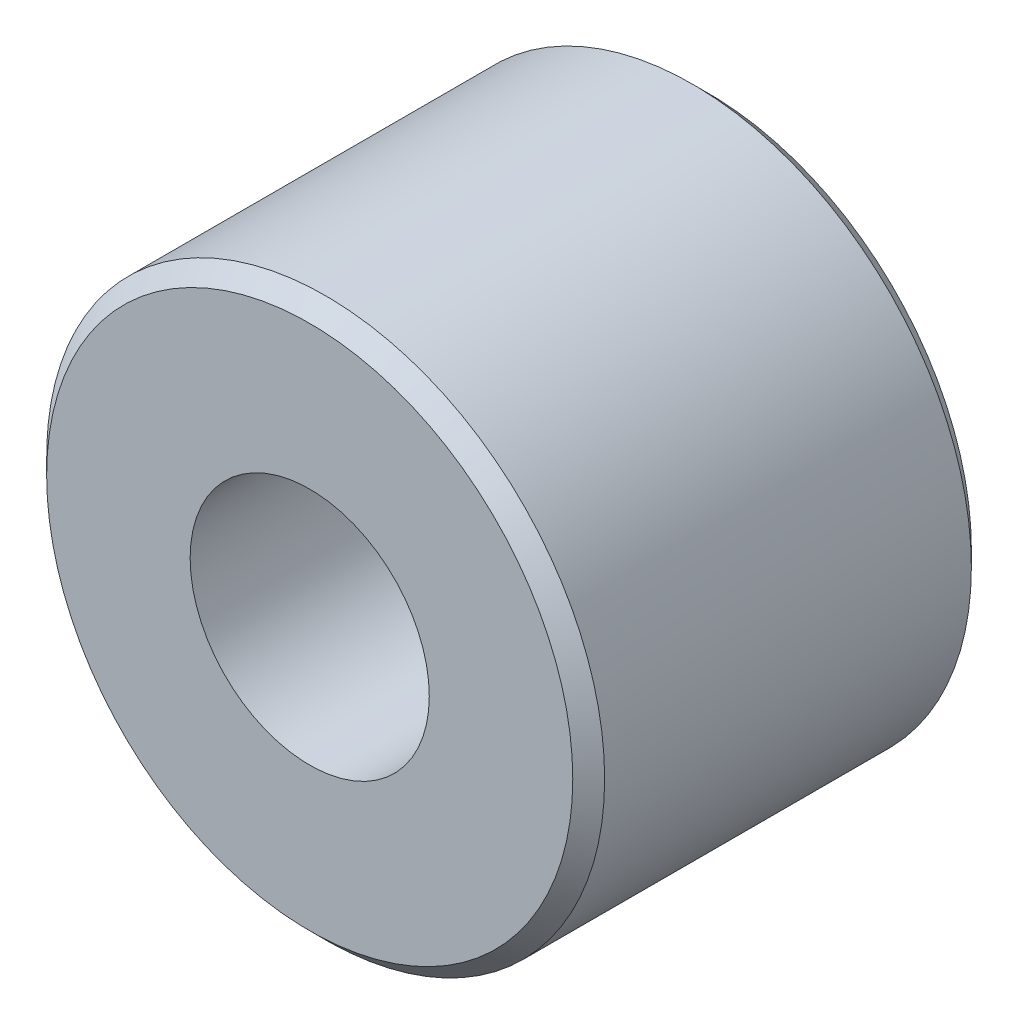
ISO-10303-21;
HEADER;
FILE_DESCRIPTION(('STEP AP214'),'2;1');
FILE_NAME('part.step','',(''),(''),'','','');
FILE_SCHEMA(('AUTOMOTIVE_DESIGN { 1 0 10303 214 1 1 1 1 }'));
ENDSEC;
DATA;
#1=APPLICATION_CONTEXT('core data for automotive mechanical design processes');
#2=APPLICATION_PROTOCOL_DEFINITION('international standard','automotive_design',2000,#1);
#3=PRODUCT_CONTEXT('',#1,'mechanical');
#4=PRODUCT('Part','Part','',(#3));
#5=PRODUCT_RELATED_PRODUCT_CATEGORY('part','',(#4));
#6=PRODUCT_DEFINITION_FORMATION('','',#4);
#7=PRODUCT_DEFINITION_CONTEXT('part definition',#1,'design');
#8=PRODUCT_DEFINITION('design','',#6,#7);
#9=PRODUCT_DEFINITION_SHAPE('','',#8);
#10=(LENGTH_UNIT() NAMED_UNIT(*) SI_UNIT(.MILLI.,.METRE.));
#11=(NAMED_UNIT(*) PLANE_ANGLE_UNIT() SI_UNIT($,.RADIAN.));
#12=(NAMED_UNIT(*) SI_UNIT($,.STERADIAN.) SOLID_ANGLE_UNIT());
#13=UNCERTAINTY_MEASURE_WITH_UNIT(LENGTH_MEASURE(1.E-05),#10,'distance_accuracy_value','');
#14=(GEOMETRIC_REPRESENTATION_CONTEXT(3) GLOBAL_UNCERTAINTY_ASSIGNED_CONTEXT((#13)) GLOBAL_UNIT_ASSIGNED_CONTEXT((#10,
#11,#12)) REPRESENTATION_CONTEXT('',''));
#15=CARTESIAN_POINT('',(0.,0.,0.));
#16=DIRECTION('',(0.,0.,1.));
#17=DIRECTION('',(1.,0.,0.));
#18=AXIS2_PLACEMENT_3D('',#15,#16,#17);
#19=CARTESIAN_POINT('',(0.,0.,5.));
#20=DIRECTION('',(0.,0.,1.));
#21=DIRECTION('',(1.,0.,0.));
#22=AXIS2_PLACEMENT_3D('',#19,#20,#21);
#23=PLANE('',#22);
#24=CARTESIAN_POINT('',(0.,0.,5.));
#25=DIRECTION('',(0.,0.,1.));
#26=DIRECTION('',(1.,0.,0.));
#27=AXIS2_PLACEMENT_3D('',#24,#25,#26);
#28=CIRCLE('',#27,3.3);
#29=CARTESIAN_POINT('',(3.3,0.,5.));
#30=VERTEX_POINT('',#29);
#31=EDGE_CURVE('E44',#30,#30,#28,.T.);
#32=ORIENTED_EDGE('',*,*,#31,.T.);
#33=EDGE_LOOP('',(#32));
#34=FACE_BOUND('',#33,.T.);
#35=CARTESIAN_POINT('',(0.,0.,5.));
#36=DIRECTION('',(0.,0.,1.));
#37=DIRECTION('',(1.,0.,0.));
#38=AXIS2_PLACEMENT_3D('',#35,#36,#37);
#39=CIRCLE('',#38,1.5);
#40=CARTESIAN_POINT('',(1.5,0.,5.));
#41=VERTEX_POINT('',#40);
#42=EDGE_CURVE('E49',#41,#41,#39,.T.);
#43=ORIENTED_EDGE('',*,*,#42,.F.);
#44=EDGE_LOOP('',(#43));
#45=FACE_BOUND('',#44,.T.);
#46=ADVANCED_FACE('F29',(#34,#45),#23,.T.);
#47=CARTESIAN_POINT('',(0.,0.,0.));
#48=DIRECTION('',(0.,0.,1.));
#49=DIRECTION('',(1.,0.,0.));
#50=AXIS2_PLACEMENT_3D('',#47,#48,#49);
#51=PLANE('',#50);
#52=CARTESIAN_POINT('',(0.,0.,0.));
#53=DIRECTION('',(0.,0.,1.));
#54=DIRECTION('',(1.,0.,0.));
#55=AXIS2_PLACEMENT_3D('',#52,#53,#54);
#56=CIRCLE('',#55,3.3);
#57=CARTESIAN_POINT('',(3.3,0.,0.));
#58=VERTEX_POINT('',#57);
#59=EDGE_CURVE('E10',#58,#58,#56,.F.);
#60=ORIENTED_EDGE('',*,*,#59,.T.);
#61=EDGE_LOOP('',(#60));
#62=FACE_BOUND('',#61,.T.);
#63=CARTESIAN_POINT('',(0.,0.,0.));
#64=DIRECTION('',(0.,0.,1.));
#65=DIRECTION('',(1.,0.,0.));
#66=AXIS2_PLACEMENT_3D('',#63,#64,#65);
#67=CIRCLE('',#66,1.5);
#68=CARTESIAN_POINT('',(1.5,0.,0.));
#69=VERTEX_POINT('',#68);
#70=EDGE_CURVE('E52',#69,#69,#67,.T.);
#71=ORIENTED_EDGE('',*,*,#70,.T.);
#72=EDGE_LOOP('',(#71));
#73=FACE_BOUND('',#72,.T.);
#74=ADVANCED_FACE('F56',(#62,#73),#51,.F.);
#75=CARTESIAN_POINT('',(0.,0.,5.));
#76=DIRECTION('',(0.,0.,-1.));
#77=DIRECTION('',(-1.,0.,0.));
#78=AXIS2_PLACEMENT_3D('',#75,#76,#77);
#79=CYLINDRICAL_SURFACE('',#78,3.5);
#80=CARTESIAN_POINT('',(0.,0.,4.8));
#81=DIRECTION('',(0.,0.,1.));
#82=DIRECTION('',(1.,0.,0.));
#83=AXIS2_PLACEMENT_3D('',#80,#81,#82);
#84=CIRCLE('',#83,3.5);
#85=CARTESIAN_POINT('',(3.5,0.,4.8));
#86=VERTEX_POINT('',#85);
#87=EDGE_CURVE('E36',#86,#86,#84,.F.);
#88=ORIENTED_EDGE('',*,*,#87,.T.);
#89=EDGE_LOOP('',(#88));
#90=FACE_BOUND('',#89,.T.);
#91=CARTESIAN_POINT('',(0.,0.,0.200000000000003));
#92=DIRECTION('',(0.,0.,1.));
#93=DIRECTION('',(1.,0.,0.));
#94=AXIS2_PLACEMENT_3D('',#91,#92,#93);
#95=CIRCLE('',#94,3.5);
#96=CARTESIAN_POINT('',(3.5,0.,0.200000000000003));
#97=VERTEX_POINT('',#96);
#98=EDGE_CURVE('E40',#97,#97,#95,.T.);
#99=ORIENTED_EDGE('',*,*,#98,.T.);
#100=EDGE_LOOP('',(#99));
#101=FACE_BOUND('',#100,.T.);
#102=ADVANCED_FACE('F31',(#90,#101),#79,.T.);
#103=CARTESIAN_POINT('',(0.,0.,5.));
#104=DIRECTION('',(0.,0.,-1.));
#105=DIRECTION('',(-1.,0.,0.));
#106=AXIS2_PLACEMENT_3D('',#103,#104,#105);
#107=CYLINDRICAL_SURFACE('',#106,1.5);
#108=ORIENTED_EDGE('',*,*,#42,.T.);
#109=EDGE_LOOP('',(#108));
#110=FACE_BOUND('',#109,.T.);
#111=ORIENTED_EDGE('',*,*,#70,.F.);
#112=EDGE_LOOP('',(#111));
#113=FACE_BOUND('',#112,.T.);
#114=ADVANCED_FACE('F58',(#110,#113),#107,.F.);
#115=CARTESIAN_POINT('',(0.,0.,5.));
#116=DIRECTION('',(0.,0.,-1.));
#117=DIRECTION('',(-1.,0.,0.));
#118=AXIS2_PLACEMENT_3D('',#115,#116,#117);
#119=CONICAL_SURFACE('',#118,3.3,0.785398163397444);
#120=ORIENTED_EDGE('',*,*,#87,.F.);
#121=EDGE_LOOP('',(#120));
#122=FACE_BOUND('',#121,.T.);
#123=ORIENTED_EDGE('',*,*,#31,.F.);
#124=EDGE_LOOP('',(#123));
#125=FACE_BOUND('',#124,.T.);
#126=ADVANCED_FACE('F60',(#122,#125),#119,.T.);
#127=CARTESIAN_POINT('',(0.,0.,0.200000000000003));
#128=DIRECTION('',(0.,0.,1.));
#129=DIRECTION('',(1.,0.,0.));
#130=AXIS2_PLACEMENT_3D('',#127,#128,#129);
#131=CONICAL_SURFACE('',#130,3.5,0.785398163397444);
#132=ORIENTED_EDGE('',*,*,#59,.F.);
#133=EDGE_LOOP('',(#132));
#134=FACE_BOUND('',#133,.T.);
#135=ORIENTED_EDGE('',*,*,#98,.F.);
#136=EDGE_LOOP('',(#135));
#137=FACE_BOUND('',#136,.T.);
#138=ADVANCED_FACE('F67',(#134,#137),#131,.T.);
#139=CLOSED_SHELL('',(#46,#74,#102,#114,#126,#138));
#140=MANIFOLD_SOLID_BREP('B2',#139);
#141=ADVANCED_BREP_SHAPE_REPRESENTATION('',(#18,#140),#14);
#142=SHAPE_DEFINITION_REPRESENTATION(#9,#141);
ENDSEC;
END-ISO-10303-21;
